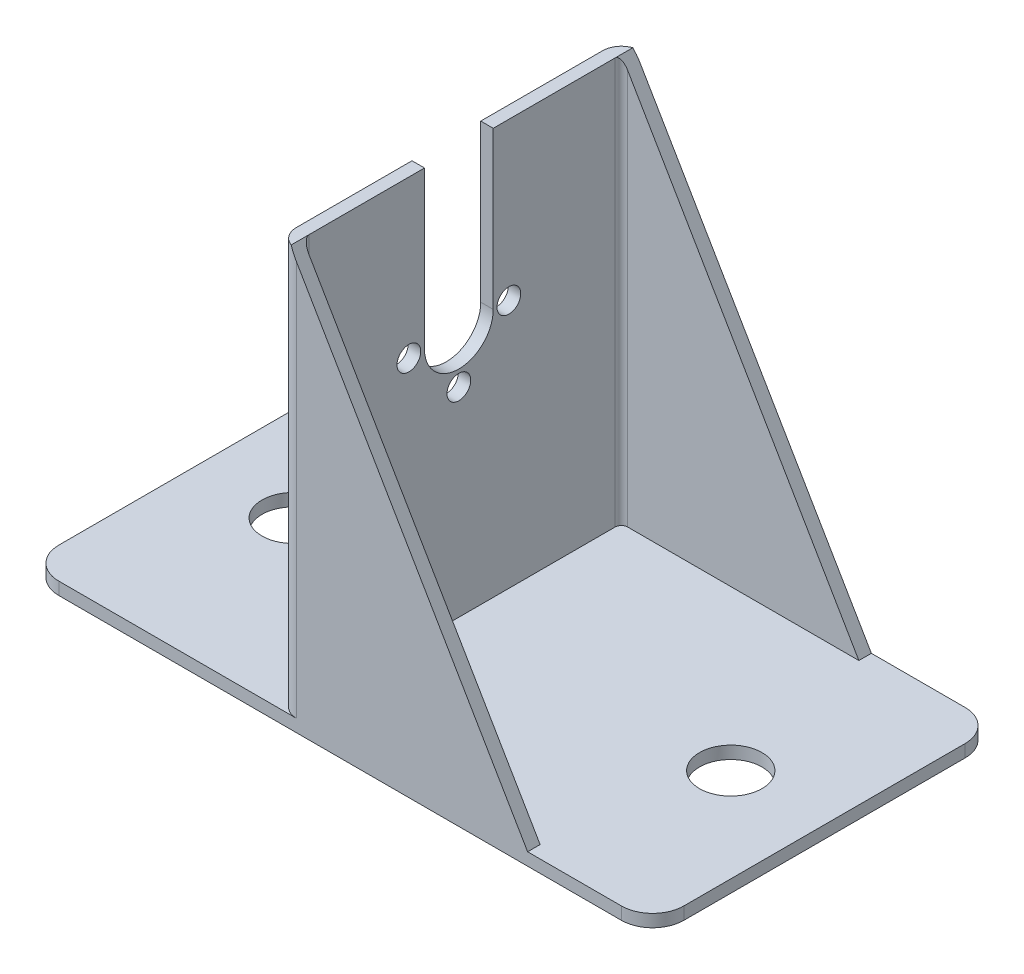
ISO-10303-21;
HEADER;
FILE_DESCRIPTION(('STEP AP214'),'2;1');
FILE_NAME('part.step','',(''),(''),'','','');
FILE_SCHEMA(('AUTOMOTIVE_DESIGN { 1 0 10303 214 1 1 1 1 }'));
ENDSEC;
DATA;
#1=APPLICATION_CONTEXT('core data for automotive mechanical design processes');
#2=APPLICATION_PROTOCOL_DEFINITION('international standard','automotive_design',2000,#1);
#3=PRODUCT_CONTEXT('',#1,'mechanical');
#4=PRODUCT('Part','Part','',(#3));
#5=PRODUCT_RELATED_PRODUCT_CATEGORY('part','',(#4));
#6=PRODUCT_DEFINITION_FORMATION('','',#4);
#7=PRODUCT_DEFINITION_CONTEXT('part definition',#1,'design');
#8=PRODUCT_DEFINITION('design','',#6,#7);
#9=PRODUCT_DEFINITION_SHAPE('','',#8);
#10=(LENGTH_UNIT() NAMED_UNIT(*) SI_UNIT(.MILLI.,.METRE.));
#11=(NAMED_UNIT(*) PLANE_ANGLE_UNIT() SI_UNIT($,.RADIAN.));
#12=(NAMED_UNIT(*) SI_UNIT($,.STERADIAN.) SOLID_ANGLE_UNIT());
#13=UNCERTAINTY_MEASURE_WITH_UNIT(LENGTH_MEASURE(1.E-05),#10,'distance_accuracy_value','');
#14=(GEOMETRIC_REPRESENTATION_CONTEXT(3) GLOBAL_UNCERTAINTY_ASSIGNED_CONTEXT((#13)) GLOBAL_UNIT_ASSIGNED_CONTEXT((#10,
#11,#12)) REPRESENTATION_CONTEXT('',''));
#15=CARTESIAN_POINT('',(0.,0.,0.));
#16=DIRECTION('',(0.,0.,1.));
#17=DIRECTION('',(1.,0.,0.));
#18=AXIS2_PLACEMENT_3D('',#15,#16,#17);
#19=CARTESIAN_POINT('',(-7.,67.,-24.5));
#20=DIRECTION('',(0.,1.,0.));
#21=DIRECTION('',(0.,0.,1.));
#22=AXIS2_PLACEMENT_3D('',#19,#20,#21);
#23=PLANE('',#22);
#24=DIRECTION('',(1.,0.,0.));
#25=VECTOR('',#24,1.);
#26=CARTESIAN_POINT('',(-42.5170724390707,67.,5.99999999982217));
#27=LINE('',#26,#25);
#28=CARTESIAN_POINT('',(-10.,67.,5.99999999982217));
#29=VERTEX_POINT('',#28);
#30=CARTESIAN_POINT('',(-8.,67.,5.99999999982216));
#31=VERTEX_POINT('',#30);
#32=EDGE_CURVE('E218',#29,#31,#27,.T.);
#33=ORIENTED_EDGE('',*,*,#32,.F.);
#34=DIRECTION('',(0.,0.,1.));
#35=VECTOR('',#34,1.);
#36=CARTESIAN_POINT('',(-10.,67.,-24.5));
#37=LINE('',#36,#35);
#38=CARTESIAN_POINT('',(-10.,67.,24.5));
#39=VERTEX_POINT('',#38);
#40=EDGE_CURVE('E248',#29,#39,#37,.T.);
#41=ORIENTED_EDGE('',*,*,#40,.T.);
#42=CARTESIAN_POINT('',(-7.,67.,24.5));
#43=DIRECTION('',(0.,1.,0.));
#44=DIRECTION('',(0.,0.,1.));
#45=AXIS2_PLACEMENT_3D('',#42,#43,#44);
#46=CIRCLE('',#45,3.);
#47=CARTESIAN_POINT('',(-8.,67.,27.3284271247462));
#48=VERTEX_POINT('',#47);
#49=EDGE_CURVE('E253',#39,#48,#46,.T.);
#50=ORIENTED_EDGE('',*,*,#49,.T.);
#51=DIRECTION('',(0.,0.,1.));
#52=VECTOR('',#51,1.);
#53=CARTESIAN_POINT('',(-8.,67.,-24.5));
#54=LINE('',#53,#52);
#55=CARTESIAN_POINT('',(-8.,67.,24.5));
#56=VERTEX_POINT('',#55);
#57=EDGE_CURVE('E332',#56,#48,#54,.T.);
#58=ORIENTED_EDGE('',*,*,#57,.F.);
#59=DIRECTION('',(0.,0.,-1.));
#60=VECTOR('',#59,1.);
#61=CARTESIAN_POINT('',(-8.,67.,-24.5));
#62=LINE('',#61,#60);
#63=EDGE_CURVE('E256',#56,#31,#62,.T.);
#64=ORIENTED_EDGE('',*,*,#63,.T.);
#65=EDGE_LOOP('',(#33,#41,#50,#58,#64));
#66=FACE_BOUND('',#65,.T.);
#67=ADVANCED_FACE('F34',(#66),#23,.T.);
#68=CARTESIAN_POINT('',(0.,2.,0.));
#69=DIRECTION('',(0.,-1.,0.));
#70=DIRECTION('',(0.,0.,-1.));
#71=AXIS2_PLACEMENT_3D('',#68,#69,#70);
#72=PLANE('',#71);
#73=CARTESIAN_POINT('',(35.,2.,0.));
#74=DIRECTION('',(0.,1.,0.));
#75=DIRECTION('',(0.,0.,1.));
#76=AXIS2_PLACEMENT_3D('',#73,#74,#75);
#77=CIRCLE('',#76,5.);
#78=CARTESIAN_POINT('',(35.,2.,4.99999999999997));
#79=VERTEX_POINT('',#78);
#80=EDGE_CURVE('E308',#79,#79,#77,.T.);
#81=ORIENTED_EDGE('',*,*,#80,.F.);
#82=EDGE_LOOP('',(#81));
#83=FACE_BOUND('',#82,.T.);
#84=DIRECTION('',(0.,0.,-1.));
#85=VECTOR('',#84,1.);
#86=CARTESIAN_POINT('',(50.,2.,27.5));
#87=LINE('',#86,#85);
#88=CARTESIAN_POINT('',(50.,2.,22.5));
#89=VERTEX_POINT('',#88);
#90=CARTESIAN_POINT('',(50.,2.,-22.5));
#91=VERTEX_POINT('',#90);
#92=EDGE_CURVE('E320',#89,#91,#87,.T.);
#93=ORIENTED_EDGE('',*,*,#92,.T.);
#94=CARTESIAN_POINT('',(45.,2.,-22.5));
#95=DIRECTION('',(0.,-1.,0.));
#96=DIRECTION('',(0.,0.,-1.));
#97=AXIS2_PLACEMENT_3D('',#94,#95,#96);
#98=CIRCLE('',#97,5.);
#99=CARTESIAN_POINT('',(45.,2.,-27.5));
#100=VERTEX_POINT('',#99);
#101=EDGE_CURVE('E11',#91,#100,#98,.F.);
#102=ORIENTED_EDGE('',*,*,#101,.T.);
#103=DIRECTION('',(-1.,0.,0.));
#104=VECTOR('',#103,1.);
#105=CARTESIAN_POINT('',(-50.,2.,-27.5));
#106=LINE('',#105,#104);
#107=CARTESIAN_POINT('',(30.,2.,-27.5));
#108=VERTEX_POINT('',#107);
#109=EDGE_CURVE('E324',#100,#108,#106,.T.);
#110=ORIENTED_EDGE('',*,*,#109,.T.);
#111=DIRECTION('',(0.,0.,-1.));
#112=VECTOR('',#111,1.);
#113=CARTESIAN_POINT('',(30.,2.,-27.5));
#114=LINE('',#113,#112);
#115=CARTESIAN_POINT('',(30.,2.,-25.5));
#116=VERTEX_POINT('',#115);
#117=EDGE_CURVE('E245',#116,#108,#114,.T.);
#118=ORIENTED_EDGE('',*,*,#117,.F.);
#119=DIRECTION('',(1.,0.,0.));
#120=VECTOR('',#119,1.);
#121=CARTESIAN_POINT('',(30.,2.,-25.5));
#122=LINE('',#121,#120);
#123=CARTESIAN_POINT('',(-6.99999999999995,2.,-25.5));
#124=VERTEX_POINT('',#123);
#125=EDGE_CURVE('E249',#124,#116,#122,.T.);
#126=ORIENTED_EDGE('',*,*,#125,.F.);
#127=CARTESIAN_POINT('',(-7.,2.,-24.5));
#128=DIRECTION('',(0.,-1.,0.));
#129=DIRECTION('',(0.,0.,1.));
#130=AXIS2_PLACEMENT_3D('',#127,#128,#129);
#131=CIRCLE('',#130,1.);
#132=CARTESIAN_POINT('',(-8.,2.,-24.5));
#133=VERTEX_POINT('',#132);
#134=EDGE_CURVE('E282',#133,#124,#131,.T.);
#135=ORIENTED_EDGE('',*,*,#134,.F.);
#136=DIRECTION('',(0.,0.,-1.));
#137=VECTOR('',#136,1.);
#138=CARTESIAN_POINT('',(-8.,2.,-24.5));
#139=LINE('',#138,#137);
#140=CARTESIAN_POINT('',(-8.,2.,24.5));
#141=VERTEX_POINT('',#140);
#142=EDGE_CURVE('E279',#141,#133,#139,.T.);
#143=ORIENTED_EDGE('',*,*,#142,.F.);
#144=CARTESIAN_POINT('',(-7.,2.,24.5));
#145=DIRECTION('',(0.,-1.,0.));
#146=DIRECTION('',(0.,0.,1.));
#147=AXIS2_PLACEMENT_3D('',#144,#145,#146);
#148=CIRCLE('',#147,1.);
#149=CARTESIAN_POINT('',(-6.99999999999998,2.,25.5));
#150=VERTEX_POINT('',#149);
#151=EDGE_CURVE('E276',#150,#141,#148,.T.);
#152=ORIENTED_EDGE('',*,*,#151,.F.);
#153=DIRECTION('',(-1.,0.,0.));
#154=VECTOR('',#153,1.);
#155=CARTESIAN_POINT('',(-6.99999999999998,2.,25.5));
#156=LINE('',#155,#154);
#157=CARTESIAN_POINT('',(30.,2.,25.5));
#158=VERTEX_POINT('',#157);
#159=EDGE_CURVE('E273',#158,#150,#156,.T.);
#160=ORIENTED_EDGE('',*,*,#159,.F.);
#161=DIRECTION('',(0.,0.,-1.));
#162=VECTOR('',#161,1.);
#163=CARTESIAN_POINT('',(30.,2.,25.5));
#164=LINE('',#163,#162);
#165=CARTESIAN_POINT('',(30.,2.,27.5));
#166=VERTEX_POINT('',#165);
#167=EDGE_CURVE('E271',#166,#158,#164,.T.);
#168=ORIENTED_EDGE('',*,*,#167,.F.);
#169=DIRECTION('',(1.,0.,0.));
#170=VECTOR('',#169,1.);
#171=CARTESIAN_POINT('',(-50.,2.,27.5));
#172=LINE('',#171,#170);
#173=CARTESIAN_POINT('',(45.,2.,27.5));
#174=VERTEX_POINT('',#173);
#175=EDGE_CURVE('E329',#166,#174,#172,.T.);
#176=ORIENTED_EDGE('',*,*,#175,.T.);
#177=CARTESIAN_POINT('',(45.,2.,22.5));
#178=DIRECTION('',(0.,-1.,0.));
#179=DIRECTION('',(0.,0.,-1.));
#180=AXIS2_PLACEMENT_3D('',#177,#178,#179);
#181=CIRCLE('',#180,5.);
#182=EDGE_CURVE('E42',#174,#89,#181,.F.);
#183=ORIENTED_EDGE('',*,*,#182,.T.);
#184=EDGE_LOOP('',(#93,#102,#110,#118,#126,#135,#143,#152,#160,#168,#176,#183));
#185=FACE_BOUND('',#184,.T.);
#186=ADVANCED_FACE('F377',(#83,#185),#72,.F.);
#187=CARTESIAN_POINT('',(50.,2.,27.5));
#188=DIRECTION('',(-1.,0.,0.));
#189=DIRECTION('',(0.,0.,1.));
#190=AXIS2_PLACEMENT_3D('',#187,#188,#189);
#191=PLANE('',#190);
#192=DIRECTION('',(0.,0.,-1.));
#193=VECTOR('',#192,1.);
#194=CARTESIAN_POINT('',(50.,0.,27.5));
#195=LINE('',#194,#193);
#196=CARTESIAN_POINT('',(50.,0.,22.5));
#197=VERTEX_POINT('',#196);
#198=CARTESIAN_POINT('',(50.,0.,-22.5));
#199=VERTEX_POINT('',#198);
#200=EDGE_CURVE('E315',#197,#199,#195,.T.);
#201=ORIENTED_EDGE('',*,*,#200,.T.);
#202=DIRECTION('',(0.,-1.,0.));
#203=VECTOR('',#202,1.);
#204=CARTESIAN_POINT('',(50.,2.,-22.5));
#205=LINE('',#204,#203);
#206=EDGE_CURVE('E57',#199,#91,#205,.F.);
#207=ORIENTED_EDGE('',*,*,#206,.T.);
#208=ORIENTED_EDGE('',*,*,#92,.F.);
#209=DIRECTION('',(0.,-1.,0.));
#210=VECTOR('',#209,1.);
#211=CARTESIAN_POINT('',(50.,2.,22.5));
#212=LINE('',#211,#210);
#213=EDGE_CURVE('E371',#89,#197,#212,.T.);
#214=ORIENTED_EDGE('',*,*,#213,.T.);
#215=EDGE_LOOP('',(#201,#207,#208,#214));
#216=FACE_BOUND('',#215,.T.);
#217=ADVANCED_FACE('F384',(#216),#191,.F.);
#218=CARTESIAN_POINT('',(-50.,2.,-27.5));
#219=DIRECTION('',(0.,0.,1.));
#220=DIRECTION('',(1.,0.,0.));
#221=AXIS2_PLACEMENT_3D('',#218,#219,#220);
#222=PLANE('',#221);
#223=DIRECTION('',(-1.,0.,0.));
#224=VECTOR('',#223,1.);
#225=CARTESIAN_POINT('',(-50.,0.,-27.5));
#226=LINE('',#225,#224);
#227=CARTESIAN_POINT('',(45.,0.,-27.5));
#228=VERTEX_POINT('',#227);
#229=CARTESIAN_POINT('',(-45.,0.,-27.5));
#230=VERTEX_POINT('',#229);
#231=EDGE_CURVE('E334',#228,#230,#226,.T.);
#232=ORIENTED_EDGE('',*,*,#231,.T.);
#233=DIRECTION('',(0.,-1.,0.));
#234=VECTOR('',#233,1.);
#235=CARTESIAN_POINT('',(-45.,2.,-27.5));
#236=LINE('',#235,#234);
#237=CARTESIAN_POINT('',(-45.,2.,-27.5));
#238=VERTEX_POINT('',#237);
#239=EDGE_CURVE('E369',#230,#238,#236,.F.);
#240=ORIENTED_EDGE('',*,*,#239,.T.);
#241=CARTESIAN_POINT('',(-7.,2.,-27.5));
#242=VERTEX_POINT('',#241);
#243=EDGE_CURVE('E322',#242,#238,#106,.T.);
#244=ORIENTED_EDGE('',*,*,#243,.F.);
#245=DIRECTION('',(0.,-1.,0.));
#246=VECTOR('',#245,1.);
#247=CARTESIAN_POINT('',(-6.99999999999998,67.,-27.5));
#248=LINE('',#247,#246);
#249=CARTESIAN_POINT('',(-7.,65.2894736842105,-27.5));
#250=VERTEX_POINT('',#249);
#251=EDGE_CURVE('E305',#250,#242,#248,.T.);
#252=ORIENTED_EDGE('',*,*,#251,.F.);
#253=DIRECTION('',(-0.504696587331156,0.863296794119082,0.));
#254=VECTOR('',#253,1.);
#255=CARTESIAN_POINT('',(-8.,67.,-27.5));
#256=LINE('',#255,#254);
#257=EDGE_CURVE('E225',#108,#250,#256,.T.);
#258=ORIENTED_EDGE('',*,*,#257,.F.);
#259=ORIENTED_EDGE('',*,*,#109,.F.);
#260=DIRECTION('',(0.,-1.,0.));
#261=VECTOR('',#260,1.);
#262=CARTESIAN_POINT('',(45.,2.,-27.5));
#263=LINE('',#262,#261);
#264=EDGE_CURVE('E366',#100,#228,#263,.T.);
#265=ORIENTED_EDGE('',*,*,#264,.T.);
#266=EDGE_LOOP('',(#232,#240,#244,#252,#258,#259,#265));
#267=FACE_BOUND('',#266,.T.);
#268=ADVANCED_FACE('F408',(#267),#222,.F.);
#269=CARTESIAN_POINT('',(-50.,2.,27.5));
#270=DIRECTION('',(1.,0.,0.));
#271=DIRECTION('',(0.,0.,-1.));
#272=AXIS2_PLACEMENT_3D('',#269,#270,#271);
#273=PLANE('',#272);
#274=DIRECTION('',(0.,0.,1.));
#275=VECTOR('',#274,1.);
#276=CARTESIAN_POINT('',(-50.,0.,27.5));
#277=LINE('',#276,#275);
#278=CARTESIAN_POINT('',(-50.,0.,-22.5));
#279=VERTEX_POINT('',#278);
#280=CARTESIAN_POINT('',(-50.,0.,22.5));
#281=VERTEX_POINT('',#280);
#282=EDGE_CURVE('E337',#279,#281,#277,.T.);
#283=ORIENTED_EDGE('',*,*,#282,.T.);
#284=DIRECTION('',(0.,-1.,0.));
#285=VECTOR('',#284,1.);
#286=CARTESIAN_POINT('',(-50.,2.,22.5));
#287=LINE('',#286,#285);
#288=CARTESIAN_POINT('',(-50.,2.,22.5));
#289=VERTEX_POINT('',#288);
#290=EDGE_CURVE('E360',#281,#289,#287,.F.);
#291=ORIENTED_EDGE('',*,*,#290,.T.);
#292=DIRECTION('',(0.,0.,1.));
#293=VECTOR('',#292,1.);
#294=CARTESIAN_POINT('',(-50.,2.,27.5));
#295=LINE('',#294,#293);
#296=CARTESIAN_POINT('',(-50.,2.,-22.5));
#297=VERTEX_POINT('',#296);
#298=EDGE_CURVE('E326',#297,#289,#295,.T.);
#299=ORIENTED_EDGE('',*,*,#298,.F.);
#300=DIRECTION('',(0.,-1.,0.));
#301=VECTOR('',#300,1.);
#302=CARTESIAN_POINT('',(-50.,2.,-22.5));
#303=LINE('',#302,#301);
#304=EDGE_CURVE('E357',#297,#279,#303,.T.);
#305=ORIENTED_EDGE('',*,*,#304,.T.);
#306=EDGE_LOOP('',(#283,#291,#299,#305));
#307=FACE_BOUND('',#306,.T.);
#308=ADVANCED_FACE('F399',(#307),#273,.F.);
#309=CARTESIAN_POINT('',(-50.,2.,27.5));
#310=DIRECTION('',(0.,0.,-1.));
#311=DIRECTION('',(-1.,0.,0.));
#312=AXIS2_PLACEMENT_3D('',#309,#310,#311);
#313=PLANE('',#312);
#314=CARTESIAN_POINT('',(-45.,2.,27.5));
#315=VERTEX_POINT('',#314);
#316=CARTESIAN_POINT('',(-7.,2.,27.5));
#317=VERTEX_POINT('',#316);
#318=EDGE_CURVE('E330',#315,#317,#172,.T.);
#319=ORIENTED_EDGE('',*,*,#318,.F.);
#320=DIRECTION('',(0.,-1.,0.));
#321=VECTOR('',#320,1.);
#322=CARTESIAN_POINT('',(-45.,2.,27.5));
#323=LINE('',#322,#321);
#324=CARTESIAN_POINT('',(-45.,0.,27.5));
#325=VERTEX_POINT('',#324);
#326=EDGE_CURVE('E346',#315,#325,#323,.T.);
#327=ORIENTED_EDGE('',*,*,#326,.T.);
#328=DIRECTION('',(1.,0.,0.));
#329=VECTOR('',#328,1.);
#330=CARTESIAN_POINT('',(-50.,0.,27.5));
#331=LINE('',#330,#329);
#332=CARTESIAN_POINT('',(45.,0.,27.5));
#333=VERTEX_POINT('',#332);
#334=EDGE_CURVE('E323',#325,#333,#331,.T.);
#335=ORIENTED_EDGE('',*,*,#334,.T.);
#336=DIRECTION('',(0.,-1.,0.));
#337=VECTOR('',#336,1.);
#338=CARTESIAN_POINT('',(45.,2.,27.5));
#339=LINE('',#338,#337);
#340=EDGE_CURVE('E344',#333,#174,#339,.F.);
#341=ORIENTED_EDGE('',*,*,#340,.T.);
#342=ORIENTED_EDGE('',*,*,#175,.F.);
#343=DIRECTION('',(0.504696587331156,-0.863296794119082,0.));
#344=VECTOR('',#343,1.);
#345=CARTESIAN_POINT('',(-8.,67.,27.5));
#346=LINE('',#345,#344);
#347=CARTESIAN_POINT('',(-7.,65.2894736842105,27.5));
#348=VERTEX_POINT('',#347);
#349=EDGE_CURVE('E222',#348,#166,#346,.T.);
#350=ORIENTED_EDGE('',*,*,#349,.F.);
#351=DIRECTION('',(0.,-1.,0.));
#352=VECTOR('',#351,1.);
#353=CARTESIAN_POINT('',(-7.,67.,27.5));
#354=LINE('',#353,#352);
#355=EDGE_CURVE('E296',#348,#317,#354,.T.);
#356=ORIENTED_EDGE('',*,*,#355,.T.);
#357=EDGE_LOOP('',(#319,#327,#335,#341,#342,#350,#356));
#358=FACE_BOUND('',#357,.T.);
#359=ADVANCED_FACE('F391',(#358),#313,.F.);
#360=ORIENTED_EDGE('',*,*,#298,.T.);
#361=CARTESIAN_POINT('',(-45.,2.,22.5));
#362=DIRECTION('',(0.,-1.,0.));
#363=DIRECTION('',(0.,0.,-1.));
#364=AXIS2_PLACEMENT_3D('',#361,#362,#363);
#365=CIRCLE('',#364,5.);
#366=EDGE_CURVE('E364',#289,#315,#365,.F.);
#367=ORIENTED_EDGE('',*,*,#366,.T.);
#368=ORIENTED_EDGE('',*,*,#318,.T.);
#369=CARTESIAN_POINT('',(-7.,2.,24.5));
#370=DIRECTION('',(0.,1.,0.));
#371=DIRECTION('',(0.,0.,1.));
#372=AXIS2_PLACEMENT_3D('',#369,#370,#371);
#373=CIRCLE('',#372,3.);
#374=CARTESIAN_POINT('',(-10.,2.,24.5));
#375=VERTEX_POINT('',#374);
#376=EDGE_CURVE('E268',#375,#317,#373,.T.);
#377=ORIENTED_EDGE('',*,*,#376,.F.);
#378=DIRECTION('',(0.,0.,1.));
#379=VECTOR('',#378,1.);
#380=CARTESIAN_POINT('',(-10.,2.,-24.5));
#381=LINE('',#380,#379);
#382=CARTESIAN_POINT('',(-10.,2.,-24.5));
#383=VERTEX_POINT('',#382);
#384=EDGE_CURVE('E265',#383,#375,#381,.T.);
#385=ORIENTED_EDGE('',*,*,#384,.F.);
#386=CARTESIAN_POINT('',(-7.,2.,-24.5));
#387=DIRECTION('',(0.,1.,0.));
#388=DIRECTION('',(0.,0.,1.));
#389=AXIS2_PLACEMENT_3D('',#386,#387,#388);
#390=CIRCLE('',#389,3.);
#391=EDGE_CURVE('E262',#242,#383,#390,.T.);
#392=ORIENTED_EDGE('',*,*,#391,.F.);
#393=ORIENTED_EDGE('',*,*,#243,.T.);
#394=CARTESIAN_POINT('',(-45.,2.,-22.5));
#395=DIRECTION('',(0.,-1.,0.));
#396=DIRECTION('',(0.,0.,-1.));
#397=AXIS2_PLACEMENT_3D('',#394,#395,#396);
#398=CIRCLE('',#397,5.);
#399=EDGE_CURVE('E362',#238,#297,#398,.F.);
#400=ORIENTED_EDGE('',*,*,#399,.T.);
#401=EDGE_LOOP('',(#360,#367,#368,#377,#385,#392,#393,#400));
#402=FACE_BOUND('',#401,.T.);
#403=CARTESIAN_POINT('',(-35.,2.,0.));
#404=DIRECTION('',(0.,1.,0.));
#405=DIRECTION('',(0.,0.,1.));
#406=AXIS2_PLACEMENT_3D('',#403,#404,#405);
#407=CIRCLE('',#406,5.);
#408=CARTESIAN_POINT('',(-35.,2.,4.99999999999998));
#409=VERTEX_POINT('',#408);
#410=EDGE_CURVE('E307',#409,#409,#407,.T.);
#411=ORIENTED_EDGE('',*,*,#410,.F.);
#412=EDGE_LOOP('',(#411));
#413=FACE_BOUND('',#412,.T.);
#414=ADVANCED_FACE('F428',(#402,#413),#72,.F.);
#415=CARTESIAN_POINT('',(0.,0.,0.));
#416=DIRECTION('',(0.,-1.,0.));
#417=DIRECTION('',(0.,0.,-1.));
#418=AXIS2_PLACEMENT_3D('',#415,#416,#417);
#419=PLANE('',#418);
#420=CARTESIAN_POINT('',(35.,0.,0.));
#421=DIRECTION('',(0.,-1.,0.));
#422=DIRECTION('',(0.,0.,-1.));
#423=AXIS2_PLACEMENT_3D('',#420,#421,#422);
#424=CIRCLE('',#423,5.);
#425=CARTESIAN_POINT('',(35.,0.,-5.00000000000002));
#426=VERTEX_POINT('',#425);
#427=EDGE_CURVE('E311',#426,#426,#424,.F.);
#428=ORIENTED_EDGE('',*,*,#427,.T.);
#429=EDGE_LOOP('',(#428));
#430=FACE_BOUND('',#429,.T.);
#431=CARTESIAN_POINT('',(-35.,0.,0.));
#432=DIRECTION('',(0.,-1.,0.));
#433=DIRECTION('',(0.,0.,-1.));
#434=AXIS2_PLACEMENT_3D('',#431,#432,#433);
#435=CIRCLE('',#434,5.);
#436=CARTESIAN_POINT('',(-35.,0.,-5.00000000000002));
#437=VERTEX_POINT('',#436);
#438=EDGE_CURVE('E312',#437,#437,#435,.F.);
#439=ORIENTED_EDGE('',*,*,#438,.T.);
#440=EDGE_LOOP('',(#439));
#441=FACE_BOUND('',#440,.T.);
#442=ORIENTED_EDGE('',*,*,#334,.F.);
#443=CARTESIAN_POINT('',(-45.,0.,22.5));
#444=DIRECTION('',(0.,-1.,0.));
#445=DIRECTION('',(0.,0.,-1.));
#446=AXIS2_PLACEMENT_3D('',#443,#444,#445);
#447=CIRCLE('',#446,5.);
#448=EDGE_CURVE('E355',#325,#281,#447,.T.);
#449=ORIENTED_EDGE('',*,*,#448,.T.);
#450=ORIENTED_EDGE('',*,*,#282,.F.);
#451=CARTESIAN_POINT('',(-45.,0.,-22.5));
#452=DIRECTION('',(0.,-1.,0.));
#453=DIRECTION('',(0.,0.,-1.));
#454=AXIS2_PLACEMENT_3D('',#451,#452,#453);
#455=CIRCLE('',#454,5.);
#456=EDGE_CURVE('E353',#279,#230,#455,.T.);
#457=ORIENTED_EDGE('',*,*,#456,.T.);
#458=ORIENTED_EDGE('',*,*,#231,.F.);
#459=CARTESIAN_POINT('',(45.,0.,-22.5));
#460=DIRECTION('',(0.,-1.,0.));
#461=DIRECTION('',(0.,0.,-1.));
#462=AXIS2_PLACEMENT_3D('',#459,#460,#461);
#463=CIRCLE('',#462,5.);
#464=EDGE_CURVE('E351',#228,#199,#463,.T.);
#465=ORIENTED_EDGE('',*,*,#464,.T.);
#466=ORIENTED_EDGE('',*,*,#200,.F.);
#467=CARTESIAN_POINT('',(45.,0.,22.5));
#468=DIRECTION('',(0.,-1.,0.));
#469=DIRECTION('',(0.,0.,-1.));
#470=AXIS2_PLACEMENT_3D('',#467,#468,#469);
#471=CIRCLE('',#470,5.);
#472=EDGE_CURVE('E349',#197,#333,#471,.T.);
#473=ORIENTED_EDGE('',*,*,#472,.T.);
#474=EDGE_LOOP('',(#442,#449,#450,#457,#458,#465,#466,#473));
#475=FACE_BOUND('',#474,.T.);
#476=ADVANCED_FACE('F388',(#430,#441,#475),#419,.T.);
#477=CARTESIAN_POINT('',(-35.,-14.142135623731,0.));
#478=DIRECTION('',(0.,1.,0.));
#479=DIRECTION('',(0.,0.,1.));
#480=AXIS2_PLACEMENT_3D('',#477,#478,#479);
#481=CYLINDRICAL_SURFACE('',#480,5.);
#482=ORIENTED_EDGE('',*,*,#410,.T.);
#483=EDGE_LOOP('',(#482));
#484=FACE_BOUND('',#483,.T.);
#485=ORIENTED_EDGE('',*,*,#438,.F.);
#486=EDGE_LOOP('',(#485));
#487=FACE_BOUND('',#486,.T.);
#488=ADVANCED_FACE('F526',(#484,#487),#481,.F.);
#489=CARTESIAN_POINT('',(35.,-14.142135623731,0.));
#490=DIRECTION('',(0.,1.,0.));
#491=DIRECTION('',(0.,0.,1.));
#492=AXIS2_PLACEMENT_3D('',#489,#490,#491);
#493=CYLINDRICAL_SURFACE('',#492,5.);
#494=ORIENTED_EDGE('',*,*,#80,.T.);
#495=EDGE_LOOP('',(#494));
#496=FACE_BOUND('',#495,.T.);
#497=ORIENTED_EDGE('',*,*,#427,.F.);
#498=EDGE_LOOP('',(#497));
#499=FACE_BOUND('',#498,.T.);
#500=ADVANCED_FACE('F523',(#496,#499),#493,.F.);
#501=CARTESIAN_POINT('',(-7.,67.,-24.5));
#502=DIRECTION('',(0.,-1.,0.));
#503=DIRECTION('',(0.,0.,-1.));
#504=AXIS2_PLACEMENT_3D('',#501,#502,#503);
#505=CYLINDRICAL_SURFACE('',#504,3.);
#506=CARTESIAN_POINT('',(-7.,67.,-24.5));
#507=DIRECTION('',(0.,1.,0.));
#508=DIRECTION('',(0.,0.,1.));
#509=AXIS2_PLACEMENT_3D('',#506,#507,#508);
#510=CIRCLE('',#509,3.);
#511=CARTESIAN_POINT('',(-8.,67.,-27.3284271247462));
#512=VERTEX_POINT('',#511);
#513=CARTESIAN_POINT('',(-10.,67.,-24.5));
#514=VERTEX_POINT('',#513);
#515=EDGE_CURVE('E246',#512,#514,#510,.T.);
#516=ORIENTED_EDGE('',*,*,#515,.F.);
#517=CARTESIAN_POINT('',(-7.,65.2894736842105,-24.5));
#518=DIRECTION('',(-0.863296794119082,-0.504696587331156,0.));
#519=DIRECTION('',(0.504696587331156,-0.863296794119082,0.));
#520=AXIS2_PLACEMENT_3D('',#517,#518,#519);
#521=ELLIPSE('',#520,5.9441654160256,3.);
#522=EDGE_CURVE('E242',#512,#250,#521,.T.);
#523=ORIENTED_EDGE('',*,*,#522,.T.);
#524=ORIENTED_EDGE('',*,*,#251,.T.);
#525=ORIENTED_EDGE('',*,*,#391,.T.);
#526=DIRECTION('',(0.,-1.,0.));
#527=VECTOR('',#526,1.);
#528=CARTESIAN_POINT('',(-10.,67.,-24.5));
#529=LINE('',#528,#527);
#530=EDGE_CURVE('E302',#514,#383,#529,.T.);
#531=ORIENTED_EDGE('',*,*,#530,.F.);
#532=EDGE_LOOP('',(#516,#523,#524,#525,#531));
#533=FACE_BOUND('',#532,.T.);
#534=ADVANCED_FACE('F425',(#533),#505,.T.);
#535=CARTESIAN_POINT('',(-10.,67.,-24.5));
#536=DIRECTION('',(1.,0.,0.));
#537=DIRECTION('',(0.,0.,-1.));
#538=AXIS2_PLACEMENT_3D('',#535,#536,#537);
#539=PLANE('',#538);
#540=CARTESIAN_POINT('',(-10.,41.899999999873,-7.50000000017783));
#541=DIRECTION('',(1.,0.,0.));
#542=DIRECTION('',(0.,0.,-1.));
#543=AXIS2_PLACEMENT_3D('',#540,#541,#542);
#544=CIRCLE('',#543,1.9);
#545=CARTESIAN_POINT('',(-10.,41.899999999873,-9.40000000017783));
#546=VERTEX_POINT('',#545);
#547=EDGE_CURVE('E447',#546,#546,#544,.F.);
#548=ORIENTED_EDGE('',*,*,#547,.F.);
#549=EDGE_LOOP('',(#548));
#550=FACE_BOUND('',#549,.T.);
#551=CARTESIAN_POINT('',(-10.,33.899999999873,0.499999999822165));
#552=DIRECTION('',(1.,0.,0.));
#553=DIRECTION('',(0.,0.,-1.));
#554=AXIS2_PLACEMENT_3D('',#551,#552,#553);
#555=CIRCLE('',#554,1.9);
#556=CARTESIAN_POINT('',(-10.,33.899999999873,-1.40000000017783));
#557=VERTEX_POINT('',#556);
#558=EDGE_CURVE('E454',#557,#557,#555,.F.);
#559=ORIENTED_EDGE('',*,*,#558,.F.);
#560=EDGE_LOOP('',(#559));
#561=FACE_BOUND('',#560,.T.);
#562=CARTESIAN_POINT('',(-9.99999999999999,41.899999999873,8.49999999982216));
#563=DIRECTION('',(1.,0.,0.));
#564=DIRECTION('',(0.,0.,-1.));
#565=AXIS2_PLACEMENT_3D('',#562,#563,#564);
#566=CIRCLE('',#565,1.9);
#567=CARTESIAN_POINT('',(-9.99999999999999,41.899999999873,6.59999999982217));
#568=VERTEX_POINT('',#567);
#569=EDGE_CURVE('E206',#568,#568,#566,.F.);
#570=ORIENTED_EDGE('',*,*,#569,.F.);
#571=EDGE_LOOP('',(#570));
#572=FACE_BOUND('',#571,.T.);
#573=ORIENTED_EDGE('',*,*,#40,.F.);
#574=DIRECTION('',(0.,1.,0.));
#575=VECTOR('',#574,1.);
#576=CARTESIAN_POINT('',(-10.,41.899999999873,5.99999999982216));
#577=LINE('',#576,#575);
#578=CARTESIAN_POINT('',(-10.,41.899999999873,5.99999999982216));
#579=VERTEX_POINT('',#578);
#580=EDGE_CURVE('E217',#579,#29,#577,.T.);
#581=ORIENTED_EDGE('',*,*,#580,.F.);
#582=CARTESIAN_POINT('',(-10.,41.899999999873,0.499999999822165));
#583=DIRECTION('',(1.,0.,0.));
#584=DIRECTION('',(0.,0.,-1.));
#585=AXIS2_PLACEMENT_3D('',#582,#583,#584);
#586=CIRCLE('',#585,5.5);
#587=CARTESIAN_POINT('',(-10.,41.899999999873,-5.00000000017783));
#588=VERTEX_POINT('',#587);
#589=EDGE_CURVE('E223',#588,#579,#586,.F.);
#590=ORIENTED_EDGE('',*,*,#589,.F.);
#591=DIRECTION('',(0.,-1.,0.));
#592=VECTOR('',#591,1.);
#593=CARTESIAN_POINT('',(-10.,41.899999999873,-5.00000000017783));
#594=LINE('',#593,#592);
#595=CARTESIAN_POINT('',(-10.,67.,-5.00000000017783));
#596=VERTEX_POINT('',#595);
#597=EDGE_CURVE('E192',#596,#588,#594,.T.);
#598=ORIENTED_EDGE('',*,*,#597,.F.);
#599=EDGE_CURVE('E250',#514,#596,#37,.T.);
#600=ORIENTED_EDGE('',*,*,#599,.F.);
#601=ORIENTED_EDGE('',*,*,#530,.T.);
#602=ORIENTED_EDGE('',*,*,#384,.T.);
#603=DIRECTION('',(0.,-1.,0.));
#604=VECTOR('',#603,1.);
#605=CARTESIAN_POINT('',(-10.,67.,24.5));
#606=LINE('',#605,#604);
#607=EDGE_CURVE('E299',#39,#375,#606,.T.);
#608=ORIENTED_EDGE('',*,*,#607,.F.);
#609=EDGE_LOOP('',(#573,#581,#590,#598,#600,#601,#602,#608));
#610=FACE_BOUND('',#609,.T.);
#611=ADVANCED_FACE('F433',(#550,#561,#572,#610),#539,.F.);
#612=CARTESIAN_POINT('',(-7.,67.,24.5));
#613=DIRECTION('',(0.,-1.,0.));
#614=DIRECTION('',(0.,0.,-1.));
#615=AXIS2_PLACEMENT_3D('',#612,#613,#614);
#616=CYLINDRICAL_SURFACE('',#615,3.);
#617=ORIENTED_EDGE('',*,*,#355,.F.);
#618=CARTESIAN_POINT('',(-7.,65.2894736842105,24.5));
#619=DIRECTION('',(-0.863296794119082,-0.504696587331156,0.));
#620=DIRECTION('',(0.504696587331156,-0.863296794119082,0.));
#621=AXIS2_PLACEMENT_3D('',#618,#619,#620);
#622=ELLIPSE('',#621,5.9441654160256,3.);
#623=EDGE_CURVE('E239',#348,#48,#622,.T.);
#624=ORIENTED_EDGE('',*,*,#623,.T.);
#625=ORIENTED_EDGE('',*,*,#49,.F.);
#626=ORIENTED_EDGE('',*,*,#607,.T.);
#627=ORIENTED_EDGE('',*,*,#376,.T.);
#628=EDGE_LOOP('',(#617,#624,#625,#626,#627));
#629=FACE_BOUND('',#628,.T.);
#630=ADVANCED_FACE('F438',(#629),#616,.T.);
#631=CARTESIAN_POINT('',(-6.99999999999998,67.,25.5));
#632=DIRECTION('',(0.,0.,1.));
#633=DIRECTION('',(1.,0.,0.));
#634=AXIS2_PLACEMENT_3D('',#631,#632,#633);
#635=PLANE('',#634);
#636=DIRECTION('',(0.,-1.,0.));
#637=VECTOR('',#636,1.);
#638=CARTESIAN_POINT('',(-6.99999999999998,67.,25.5));
#639=LINE('',#638,#637);
#640=CARTESIAN_POINT('',(-6.99999999999998,65.2894736842105,25.5));
#641=VERTEX_POINT('',#640);
#642=EDGE_CURVE('E294',#641,#150,#639,.T.);
#643=ORIENTED_EDGE('',*,*,#642,.F.);
#644=DIRECTION('',(0.504696587331156,-0.863296794119082,0.));
#645=VECTOR('',#644,1.);
#646=CARTESIAN_POINT('',(-7.74528135473628,66.5642970541542,25.5));
#647=LINE('',#646,#645);
#648=EDGE_CURVE('E236',#641,#158,#647,.T.);
#649=ORIENTED_EDGE('',*,*,#648,.T.);
#650=ORIENTED_EDGE('',*,*,#159,.T.);
#651=EDGE_LOOP('',(#643,#649,#650));
#652=FACE_BOUND('',#651,.T.);
#653=ADVANCED_FACE('F479',(#652),#635,.F.);
#654=CARTESIAN_POINT('',(-7.,67.,24.5));
#655=DIRECTION('',(0.,-1.,0.));
#656=DIRECTION('',(0.,0.,-1.));
#657=AXIS2_PLACEMENT_3D('',#654,#655,#656);
#658=CYLINDRICAL_SURFACE('',#657,1.);
#659=DIRECTION('',(0.,-1.,0.));
#660=VECTOR('',#659,1.);
#661=CARTESIAN_POINT('',(-8.,67.,24.5));
#662=LINE('',#661,#660);
#663=EDGE_CURVE('E291',#56,#141,#662,.T.);
#664=ORIENTED_EDGE('',*,*,#663,.F.);
#665=CARTESIAN_POINT('',(-7.,65.2894736842105,24.5));
#666=DIRECTION('',(-0.863296794119082,-0.504696587331156,0.));
#667=DIRECTION('',(0.504696587331156,-0.863296794119082,0.));
#668=AXIS2_PLACEMENT_3D('',#665,#666,#667);
#669=ELLIPSE('',#668,1.98138847200854,1.);
#670=EDGE_CURVE('E233',#56,#641,#669,.F.);
#671=ORIENTED_EDGE('',*,*,#670,.T.);
#672=ORIENTED_EDGE('',*,*,#642,.T.);
#673=ORIENTED_EDGE('',*,*,#151,.T.);
#674=EDGE_LOOP('',(#664,#671,#672,#673));
#675=FACE_BOUND('',#674,.T.);
#676=ADVANCED_FACE('F469',(#675),#658,.F.);
#677=CARTESIAN_POINT('',(-8.,67.,-24.5));
#678=DIRECTION('',(-1.,0.,0.));
#679=DIRECTION('',(0.,0.,1.));
#680=AXIS2_PLACEMENT_3D('',#677,#678,#679);
#681=PLANE('',#680);
#682=CARTESIAN_POINT('',(-8.,41.899999999873,-7.50000000017783));
#683=DIRECTION('',(1.,0.,0.));
#684=DIRECTION('',(0.,0.,-1.));
#685=AXIS2_PLACEMENT_3D('',#682,#683,#684);
#686=CIRCLE('',#685,1.9);
#687=CARTESIAN_POINT('',(-8.,41.899999999873,-9.40000000017783));
#688=VERTEX_POINT('',#687);
#689=EDGE_CURVE('E451',#688,#688,#686,.T.);
#690=ORIENTED_EDGE('',*,*,#689,.F.);
#691=EDGE_LOOP('',(#690));
#692=FACE_BOUND('',#691,.T.);
#693=CARTESIAN_POINT('',(-8.,33.899999999873,0.499999999822165));
#694=DIRECTION('',(1.,0.,0.));
#695=DIRECTION('',(0.,0.,-1.));
#696=AXIS2_PLACEMENT_3D('',#693,#694,#695);
#697=CIRCLE('',#696,1.9);
#698=CARTESIAN_POINT('',(-8.,33.899999999873,-1.40000000017783));
#699=VERTEX_POINT('',#698);
#700=EDGE_CURVE('E450',#699,#699,#697,.T.);
#701=ORIENTED_EDGE('',*,*,#700,.F.);
#702=EDGE_LOOP('',(#701));
#703=FACE_BOUND('',#702,.T.);
#704=CARTESIAN_POINT('',(-8.,41.899999999873,8.49999999982216));
#705=DIRECTION('',(1.,0.,0.));
#706=DIRECTION('',(0.,0.,-1.));
#707=AXIS2_PLACEMENT_3D('',#704,#705,#706);
#708=CIRCLE('',#707,1.9);
#709=CARTESIAN_POINT('',(-8.,41.899999999873,6.59999999982217));
#710=VERTEX_POINT('',#709);
#711=EDGE_CURVE('E457',#710,#710,#708,.T.);
#712=ORIENTED_EDGE('',*,*,#711,.F.);
#713=EDGE_LOOP('',(#712));
#714=FACE_BOUND('',#713,.T.);
#715=CARTESIAN_POINT('',(-8.,41.899999999873,0.499999999822165));
#716=DIRECTION('',(1.,0.,0.));
#717=DIRECTION('',(0.,0.,-1.));
#718=AXIS2_PLACEMENT_3D('',#715,#716,#717);
#719=CIRCLE('',#718,5.5);
#720=CARTESIAN_POINT('',(-8.,41.899999999873,5.99999999982216));
#721=VERTEX_POINT('',#720);
#722=CARTESIAN_POINT('',(-8.,41.899999999873,-5.00000000017783));
#723=VERTEX_POINT('',#722);
#724=EDGE_CURVE('E199',#721,#723,#719,.T.);
#725=ORIENTED_EDGE('',*,*,#724,.F.);
#726=DIRECTION('',(0.,-1.,0.));
#727=VECTOR('',#726,1.);
#728=CARTESIAN_POINT('',(-8.,41.899999999873,5.99999999982216));
#729=LINE('',#728,#727);
#730=EDGE_CURVE('E196',#31,#721,#729,.T.);
#731=ORIENTED_EDGE('',*,*,#730,.F.);
#732=ORIENTED_EDGE('',*,*,#63,.F.);
#733=ORIENTED_EDGE('',*,*,#663,.T.);
#734=ORIENTED_EDGE('',*,*,#142,.T.);
#735=DIRECTION('',(0.,-1.,0.));
#736=VECTOR('',#735,1.);
#737=CARTESIAN_POINT('',(-8.,67.,-24.5));
#738=LINE('',#737,#736);
#739=CARTESIAN_POINT('',(-8.,67.,-24.5));
#740=VERTEX_POINT('',#739);
#741=EDGE_CURVE('E288',#740,#133,#738,.T.);
#742=ORIENTED_EDGE('',*,*,#741,.F.);
#743=CARTESIAN_POINT('',(-8.,67.,-5.00000000017783));
#744=VERTEX_POINT('',#743);
#745=EDGE_CURVE('E211',#744,#740,#62,.T.);
#746=ORIENTED_EDGE('',*,*,#745,.F.);
#747=DIRECTION('',(0.,1.,0.));
#748=VECTOR('',#747,1.);
#749=CARTESIAN_POINT('',(-8.,41.899999999873,-5.00000000017783));
#750=LINE('',#749,#748);
#751=EDGE_CURVE('E49',#723,#744,#750,.T.);
#752=ORIENTED_EDGE('',*,*,#751,.F.);
#753=EDGE_LOOP('',(#725,#731,#732,#733,#734,#742,#746,#752));
#754=FACE_BOUND('',#753,.T.);
#755=ADVANCED_FACE('F209',(#692,#703,#714,#754),#681,.F.);
#756=CARTESIAN_POINT('',(-7.,67.,-24.5));
#757=DIRECTION('',(0.,-1.,0.));
#758=DIRECTION('',(0.,0.,-1.));
#759=AXIS2_PLACEMENT_3D('',#756,#757,#758);
#760=CYLINDRICAL_SURFACE('',#759,1.);
#761=DIRECTION('',(0.,-1.,0.));
#762=VECTOR('',#761,1.);
#763=CARTESIAN_POINT('',(-6.99999999999995,67.,-25.5));
#764=LINE('',#763,#762);
#765=CARTESIAN_POINT('',(-6.99999999999995,65.2894736842104,-25.5));
#766=VERTEX_POINT('',#765);
#767=EDGE_CURVE('E259',#766,#124,#764,.T.);
#768=ORIENTED_EDGE('',*,*,#767,.F.);
#769=CARTESIAN_POINT('',(-7.,65.2894736842105,-24.5));
#770=DIRECTION('',(-0.863296794119082,-0.504696587331156,0.));
#771=DIRECTION('',(0.504696587331156,-0.863296794119082,0.));
#772=AXIS2_PLACEMENT_3D('',#769,#770,#771);
#773=ELLIPSE('',#772,1.98138847200854,1.);
#774=EDGE_CURVE('E230',#766,#740,#773,.F.);
#775=ORIENTED_EDGE('',*,*,#774,.T.);
#776=ORIENTED_EDGE('',*,*,#741,.T.);
#777=ORIENTED_EDGE('',*,*,#134,.T.);
#778=EDGE_LOOP('',(#768,#775,#776,#777));
#779=FACE_BOUND('',#778,.T.);
#780=ADVANCED_FACE('F468',(#779),#760,.F.);
#781=CARTESIAN_POINT('',(30.,67.,-25.5));
#782=DIRECTION('',(0.,0.,-1.));
#783=DIRECTION('',(-1.,0.,0.));
#784=AXIS2_PLACEMENT_3D('',#781,#782,#783);
#785=PLANE('',#784);
#786=ORIENTED_EDGE('',*,*,#125,.T.);
#787=DIRECTION('',(-0.504696587331156,0.863296794119082,0.));
#788=VECTOR('',#787,1.);
#789=CARTESIAN_POINT('',(1.67930852002117,50.4432880578585,-25.5));
#790=LINE('',#789,#788);
#791=EDGE_CURVE('E227',#116,#766,#790,.T.);
#792=ORIENTED_EDGE('',*,*,#791,.T.);
#793=ORIENTED_EDGE('',*,*,#767,.T.);
#794=EDGE_LOOP('',(#786,#792,#793));
#795=FACE_BOUND('',#794,.T.);
#796=ADVANCED_FACE('F476',(#795),#785,.F.);
#797=DIRECTION('',(1.,0.,0.));
#798=VECTOR('',#797,1.);
#799=CARTESIAN_POINT('',(-42.5170724390707,67.,-5.00000000017783));
#800=LINE('',#799,#798);
#801=EDGE_CURVE('E195',#596,#744,#800,.T.);
#802=ORIENTED_EDGE('',*,*,#801,.T.);
#803=ORIENTED_EDGE('',*,*,#745,.T.);
#804=EDGE_CURVE('E343',#512,#740,#54,.T.);
#805=ORIENTED_EDGE('',*,*,#804,.F.);
#806=ORIENTED_EDGE('',*,*,#515,.T.);
#807=ORIENTED_EDGE('',*,*,#599,.T.);
#808=EDGE_LOOP('',(#802,#803,#805,#806,#807));
#809=FACE_BOUND('',#808,.T.);
#810=ADVANCED_FACE('F486',(#809),#23,.T.);
#811=CARTESIAN_POINT('',(-8.,67.,-102.792761936324));
#812=DIRECTION('',(-0.863296794119082,-0.504696587331156,0.));
#813=DIRECTION('',(0.504696587331156,-0.863296794119082,0.));
#814=AXIS2_PLACEMENT_3D('',#811,#812,#813);
#815=PLANE('',#814);
#816=ORIENTED_EDGE('',*,*,#349,.T.);
#817=ORIENTED_EDGE('',*,*,#167,.T.);
#818=ORIENTED_EDGE('',*,*,#648,.F.);
#819=ORIENTED_EDGE('',*,*,#670,.F.);
#820=ORIENTED_EDGE('',*,*,#57,.T.);
#821=ORIENTED_EDGE('',*,*,#623,.F.);
#822=EDGE_LOOP('',(#816,#817,#818,#819,#820,#821));
#823=FACE_BOUND('',#822,.T.);
#824=ADVANCED_FACE('F495',(#823),#815,.F.);
#825=ORIENTED_EDGE('',*,*,#804,.T.);
#826=ORIENTED_EDGE('',*,*,#774,.F.);
#827=ORIENTED_EDGE('',*,*,#791,.F.);
#828=ORIENTED_EDGE('',*,*,#117,.T.);
#829=ORIENTED_EDGE('',*,*,#257,.T.);
#830=ORIENTED_EDGE('',*,*,#522,.F.);
#831=EDGE_LOOP('',(#825,#826,#827,#828,#829,#830));
#832=FACE_BOUND('',#831,.T.);
#833=ADVANCED_FACE('F420',(#832),#815,.F.);
#834=CARTESIAN_POINT('',(-45.,2.,22.5));
#835=DIRECTION('',(0.,-1.,0.));
#836=DIRECTION('',(0.,0.,-1.));
#837=AXIS2_PLACEMENT_3D('',#834,#835,#836);
#838=CYLINDRICAL_SURFACE('',#837,5.);
#839=ORIENTED_EDGE('',*,*,#366,.F.);
#840=ORIENTED_EDGE('',*,*,#290,.F.);
#841=ORIENTED_EDGE('',*,*,#448,.F.);
#842=ORIENTED_EDGE('',*,*,#326,.F.);
#843=EDGE_LOOP('',(#839,#840,#841,#842));
#844=FACE_BOUND('',#843,.T.);
#845=ADVANCED_FACE('F395',(#844),#838,.T.);
#846=CARTESIAN_POINT('',(-45.,2.,-22.5));
#847=DIRECTION('',(0.,-1.,0.));
#848=DIRECTION('',(0.,0.,-1.));
#849=AXIS2_PLACEMENT_3D('',#846,#847,#848);
#850=CYLINDRICAL_SURFACE('',#849,5.);
#851=ORIENTED_EDGE('',*,*,#399,.F.);
#852=ORIENTED_EDGE('',*,*,#239,.F.);
#853=ORIENTED_EDGE('',*,*,#456,.F.);
#854=ORIENTED_EDGE('',*,*,#304,.F.);
#855=EDGE_LOOP('',(#851,#852,#853,#854));
#856=FACE_BOUND('',#855,.T.);
#857=ADVANCED_FACE('F404',(#856),#850,.T.);
#858=CARTESIAN_POINT('',(45.,2.,-22.5));
#859=DIRECTION('',(0.,-1.,0.));
#860=DIRECTION('',(0.,0.,-1.));
#861=AXIS2_PLACEMENT_3D('',#858,#859,#860);
#862=CYLINDRICAL_SURFACE('',#861,5.);
#863=ORIENTED_EDGE('',*,*,#101,.F.);
#864=ORIENTED_EDGE('',*,*,#206,.F.);
#865=ORIENTED_EDGE('',*,*,#464,.F.);
#866=ORIENTED_EDGE('',*,*,#264,.F.);
#867=EDGE_LOOP('',(#863,#864,#865,#866));
#868=FACE_BOUND('',#867,.T.);
#869=ADVANCED_FACE('F415',(#868),#862,.T.);
#870=CARTESIAN_POINT('',(45.,2.,22.5));
#871=DIRECTION('',(0.,-1.,0.));
#872=DIRECTION('',(0.,0.,-1.));
#873=AXIS2_PLACEMENT_3D('',#870,#871,#872);
#874=CYLINDRICAL_SURFACE('',#873,5.);
#875=ORIENTED_EDGE('',*,*,#182,.F.);
#876=ORIENTED_EDGE('',*,*,#340,.F.);
#877=ORIENTED_EDGE('',*,*,#472,.F.);
#878=ORIENTED_EDGE('',*,*,#213,.F.);
#879=EDGE_LOOP('',(#875,#876,#877,#878));
#880=FACE_BOUND('',#879,.T.);
#881=ADVANCED_FACE('F36',(#880),#874,.T.);
#882=CARTESIAN_POINT('',(-42.5170724390707,41.899999999873,0.499999999822167));
#883=DIRECTION('',(1.,0.,0.));
#884=DIRECTION('',(0.,0.,-1.));
#885=AXIS2_PLACEMENT_3D('',#882,#883,#884);
#886=CYLINDRICAL_SURFACE('',#885,5.5);
#887=ORIENTED_EDGE('',*,*,#589,.T.);
#888=DIRECTION('',(1.,0.,0.));
#889=VECTOR('',#888,1.);
#890=CARTESIAN_POINT('',(-42.5170724390707,41.899999999873,5.99999999982217));
#891=LINE('',#890,#889);
#892=EDGE_CURVE('E202',#579,#721,#891,.T.);
#893=ORIENTED_EDGE('',*,*,#892,.T.);
#894=ORIENTED_EDGE('',*,*,#724,.T.);
#895=DIRECTION('',(1.,0.,0.));
#896=VECTOR('',#895,1.);
#897=CARTESIAN_POINT('',(-42.5170724390707,41.899999999873,-5.00000000017783));
#898=LINE('',#897,#896);
#899=EDGE_CURVE('E188',#588,#723,#898,.T.);
#900=ORIENTED_EDGE('',*,*,#899,.F.);
#901=EDGE_LOOP('',(#887,#893,#894,#900));
#902=FACE_BOUND('',#901,.T.);
#903=ADVANCED_FACE('F200',(#902),#886,.F.);
#904=CARTESIAN_POINT('',(-42.5170724390707,41.899999999873,5.99999999982217));
#905=DIRECTION('',(0.,0.,1.));
#906=DIRECTION('',(1.,0.,0.));
#907=AXIS2_PLACEMENT_3D('',#904,#905,#906);
#908=PLANE('',#907);
#909=ORIENTED_EDGE('',*,*,#580,.T.);
#910=ORIENTED_EDGE('',*,*,#32,.T.);
#911=ORIENTED_EDGE('',*,*,#730,.T.);
#912=ORIENTED_EDGE('',*,*,#892,.F.);
#913=EDGE_LOOP('',(#909,#910,#911,#912));
#914=FACE_BOUND('',#913,.T.);
#915=ADVANCED_FACE('F553',(#914),#908,.F.);
#916=CARTESIAN_POINT('',(-42.5170724390707,41.899999999873,-5.00000000017783));
#917=DIRECTION('',(0.,0.,-1.));
#918=DIRECTION('',(-1.,0.,0.));
#919=AXIS2_PLACEMENT_3D('',#916,#917,#918);
#920=PLANE('',#919);
#921=ORIENTED_EDGE('',*,*,#597,.T.);
#922=ORIENTED_EDGE('',*,*,#899,.T.);
#923=ORIENTED_EDGE('',*,*,#751,.T.);
#924=ORIENTED_EDGE('',*,*,#801,.F.);
#925=EDGE_LOOP('',(#921,#922,#923,#924));
#926=FACE_BOUND('',#925,.T.);
#927=ADVANCED_FACE('F190',(#926),#920,.F.);
#928=CARTESIAN_POINT('',(-42.5170724390707,41.899999999873,8.49999999982217));
#929=DIRECTION('',(1.,0.,0.));
#930=DIRECTION('',(0.,0.,-1.));
#931=AXIS2_PLACEMENT_3D('',#928,#929,#930);
#932=CYLINDRICAL_SURFACE('',#931,1.9);
#933=ORIENTED_EDGE('',*,*,#569,.T.);
#934=EDGE_LOOP('',(#933));
#935=FACE_BOUND('',#934,.T.);
#936=ORIENTED_EDGE('',*,*,#711,.T.);
#937=EDGE_LOOP('',(#936));
#938=FACE_BOUND('',#937,.T.);
#939=ADVANCED_FACE('F465',(#935,#938),#932,.F.);
#940=CARTESIAN_POINT('',(-42.5170724390707,33.899999999873,0.499999999822167));
#941=DIRECTION('',(1.,0.,0.));
#942=DIRECTION('',(0.,0.,-1.));
#943=AXIS2_PLACEMENT_3D('',#940,#941,#942);
#944=CYLINDRICAL_SURFACE('',#943,1.9);
#945=ORIENTED_EDGE('',*,*,#558,.T.);
#946=EDGE_LOOP('',(#945));
#947=FACE_BOUND('',#946,.T.);
#948=ORIENTED_EDGE('',*,*,#700,.T.);
#949=EDGE_LOOP('',(#948));
#950=FACE_BOUND('',#949,.T.);
#951=ADVANCED_FACE('F633',(#947,#950),#944,.F.);
#952=CARTESIAN_POINT('',(-42.5170724390707,41.899999999873,-7.50000000017783));
#953=DIRECTION('',(1.,0.,0.));
#954=DIRECTION('',(0.,0.,-1.));
#955=AXIS2_PLACEMENT_3D('',#952,#953,#954);
#956=CYLINDRICAL_SURFACE('',#955,1.9);
#957=ORIENTED_EDGE('',*,*,#547,.T.);
#958=EDGE_LOOP('',(#957));
#959=FACE_BOUND('',#958,.T.);
#960=ORIENTED_EDGE('',*,*,#689,.T.);
#961=EDGE_LOOP('',(#960));
#962=FACE_BOUND('',#961,.T.);
#963=ADVANCED_FACE('F643',(#959,#962),#956,.F.);
#964=CLOSED_SHELL('',(#67,#186,#217,#268,#308,#359,#414,#476,#488,#500,#534,#611,#630,#653,#676,
#755,#780,#796,#810,#824,#833,#845,#857,#869,#881,#903,#915,#927,#939,#951,#963));
#965=MANIFOLD_SOLID_BREP('B2',#964);
#966=ADVANCED_BREP_SHAPE_REPRESENTATION('',(#18,#965),#14);
#967=SHAPE_DEFINITION_REPRESENTATION(#9,#966);
ENDSEC;
END-ISO-10303-21;
